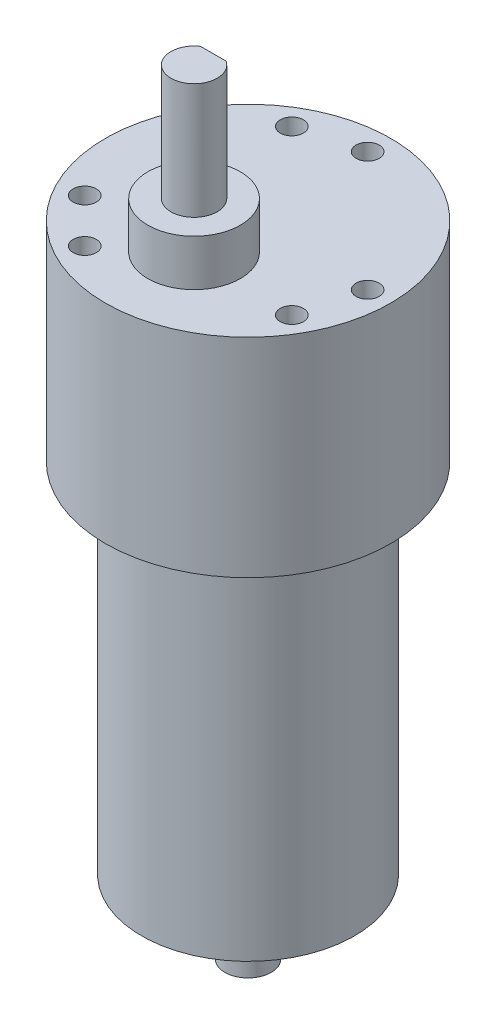
ISO-10303-21;
HEADER;
FILE_DESCRIPTION(('STEP AP214'),'2;1');
FILE_NAME('part.step','',(''),(''),'','','');
FILE_SCHEMA(('AUTOMOTIVE_DESIGN { 1 0 10303 214 1 1 1 1 }'));
ENDSEC;
DATA;
#1=APPLICATION_CONTEXT('core data for automotive mechanical design processes');
#2=APPLICATION_PROTOCOL_DEFINITION('international standard','automotive_design',2000,#1);
#3=PRODUCT_CONTEXT('',#1,'mechanical');
#4=PRODUCT('Part','Part','',(#3));
#5=PRODUCT_RELATED_PRODUCT_CATEGORY('part','',(#4));
#6=PRODUCT_DEFINITION_FORMATION('','',#4);
#7=PRODUCT_DEFINITION_CONTEXT('part definition',#1,'design');
#8=PRODUCT_DEFINITION('design','',#6,#7);
#9=PRODUCT_DEFINITION_SHAPE('','',#8);
#10=(LENGTH_UNIT() NAMED_UNIT(*) SI_UNIT(.MILLI.,.METRE.));
#11=(NAMED_UNIT(*) PLANE_ANGLE_UNIT() SI_UNIT($,.RADIAN.));
#12=(NAMED_UNIT(*) SI_UNIT($,.STERADIAN.) SOLID_ANGLE_UNIT());
#13=UNCERTAINTY_MEASURE_WITH_UNIT(LENGTH_MEASURE(1.E-05),#10,'distance_accuracy_value','');
#14=(GEOMETRIC_REPRESENTATION_CONTEXT(3) GLOBAL_UNCERTAINTY_ASSIGNED_CONTEXT((#13)) GLOBAL_UNIT_ASSIGNED_CONTEXT((#10,
#11,#12)) REPRESENTATION_CONTEXT('',''));
#15=CARTESIAN_POINT('',(0.,0.,0.));
#16=DIRECTION('',(0.,0.,1.));
#17=DIRECTION('',(1.,0.,0.));
#18=AXIS2_PLACEMENT_3D('',#15,#16,#17);
#19=CARTESIAN_POINT('',(0.,27.,0.));
#20=DIRECTION('',(0.,-1.,0.));
#21=DIRECTION('',(0.,0.,-1.));
#22=AXIS2_PLACEMENT_3D('',#19,#20,#21);
#23=CYLINDRICAL_SURFACE('',#22,18.5);
#24=CARTESIAN_POINT('',(0.,27.,0.));
#25=DIRECTION('',(0.,1.,0.));
#26=DIRECTION('',(0.,0.,1.));
#27=AXIS2_PLACEMENT_3D('',#24,#25,#26);
#28=CIRCLE('',#27,18.5);
#29=CARTESIAN_POINT('',(0.,27.,18.5));
#30=VERTEX_POINT('',#29);
#31=EDGE_CURVE('E85',#30,#30,#28,.T.);
#32=ORIENTED_EDGE('',*,*,#31,.F.);
#33=EDGE_LOOP('',(#32));
#34=FACE_BOUND('',#33,.T.);
#35=CARTESIAN_POINT('',(0.,0.,0.));
#36=DIRECTION('',(0.,1.,0.));
#37=DIRECTION('',(0.,0.,1.));
#38=AXIS2_PLACEMENT_3D('',#35,#36,#37);
#39=CIRCLE('',#38,18.5);
#40=CARTESIAN_POINT('',(0.,0.,18.5));
#41=VERTEX_POINT('',#40);
#42=EDGE_CURVE('E36',#41,#41,#39,.T.);
#43=ORIENTED_EDGE('',*,*,#42,.T.);
#44=EDGE_LOOP('',(#43));
#45=FACE_BOUND('',#44,.T.);
#46=ADVANCED_FACE('F33',(#34,#45),#23,.T.);
#47=CARTESIAN_POINT('',(0.,27.,0.));
#48=DIRECTION('',(0.,1.,0.));
#49=DIRECTION('',(0.,0.,1.));
#50=AXIS2_PLACEMENT_3D('',#47,#48,#49);
#51=PLANE('',#50);
#52=CARTESIAN_POINT('',(0.,27.,7.));
#53=DIRECTION('',(0.,1.,0.));
#54=DIRECTION('',(0.,0.,1.));
#55=AXIS2_PLACEMENT_3D('',#52,#53,#54);
#56=CIRCLE('',#55,6.);
#57=CARTESIAN_POINT('',(0.,27.,13.));
#58=VERTEX_POINT('',#57);
#59=EDGE_CURVE('E75',#58,#58,#56,.T.);
#60=ORIENTED_EDGE('',*,*,#59,.F.);
#61=EDGE_LOOP('',(#60));
#62=FACE_BOUND('',#61,.T.);
#63=CARTESIAN_POINT('',(-13.4233937586588,27.,7.75000000000006));
#64=DIRECTION('',(0.,1.,0.));
#65=DIRECTION('',(0.866025403784436,0.,-0.500000000000004));
#66=AXIS2_PLACEMENT_3D('',#63,#64,#65);
#67=CIRCLE('',#66,1.5);
#68=CARTESIAN_POINT('',(-12.1243556529821,27.,7.00000000000006));
#69=VERTEX_POINT('',#68);
#70=EDGE_CURVE('E93',#69,#69,#67,.T.);
#71=ORIENTED_EDGE('',*,*,#70,.F.);
#72=EDGE_LOOP('',(#71));
#73=FACE_BOUND('',#72,.T.);
#74=CARTESIAN_POINT('',(-7.74999999999992,27.,13.4233937586589));
#75=DIRECTION('',(0.,1.,0.));
#76=DIRECTION('',(0.866025403784436,0.,-0.500000000000004));
#77=AXIS2_PLACEMENT_3D('',#74,#75,#76);
#78=CIRCLE('',#77,1.5);
#79=CARTESIAN_POINT('',(-6.45096189432327,27.,12.6733937586588));
#80=VERTEX_POINT('',#79);
#81=EDGE_CURVE('E99',#80,#80,#78,.T.);
#82=ORIENTED_EDGE('',*,*,#81,.F.);
#83=EDGE_LOOP('',(#82));
#84=FACE_BOUND('',#83,.T.);
#85=CARTESIAN_POINT('',(13.4233937586589,27.,7.74999999999987));
#86=DIRECTION('',(0.,1.,0.));
#87=DIRECTION('',(-0.866025403784443,0.,-0.499999999999992));
#88=AXIS2_PLACEMENT_3D('',#85,#86,#87);
#89=CIRCLE('',#88,1.5);
#90=CARTESIAN_POINT('',(12.1243556529822,27.,6.99999999999989));
#91=VERTEX_POINT('',#90);
#92=EDGE_CURVE('E105',#91,#91,#89,.T.);
#93=ORIENTED_EDGE('',*,*,#92,.F.);
#94=EDGE_LOOP('',(#93));
#95=FACE_BOUND('',#94,.T.);
#96=CARTESIAN_POINT('',(15.5,27.,-1.67400815431762E-13));
#97=DIRECTION('',(0.,1.,0.));
#98=DIRECTION('',(-0.866025403784443,0.,-0.499999999999992));
#99=AXIS2_PLACEMENT_3D('',#96,#97,#98);
#100=CIRCLE('',#99,1.5);
#101=CARTESIAN_POINT('',(14.2009618943233,27.,-0.750000000000155));
#102=VERTEX_POINT('',#101);
#103=EDGE_CURVE('E87',#102,#102,#100,.T.);
#104=ORIENTED_EDGE('',*,*,#103,.F.);
#105=EDGE_LOOP('',(#104));
#106=FACE_BOUND('',#105,.T.);
#107=CARTESIAN_POINT('',(0.,27.,-15.5));
#108=DIRECTION('',(0.,1.,0.));
#109=DIRECTION('',(0.,0.,1.));
#110=AXIS2_PLACEMENT_3D('',#107,#108,#109);
#111=CIRCLE('',#110,1.5);
#112=CARTESIAN_POINT('',(0.,27.,-14.));
#113=VERTEX_POINT('',#112);
#114=EDGE_CURVE('E116',#113,#113,#111,.T.);
#115=ORIENTED_EDGE('',*,*,#114,.F.);
#116=EDGE_LOOP('',(#115));
#117=FACE_BOUND('',#116,.T.);
#118=CARTESIAN_POINT('',(-7.75000000000002,27.,-13.4233937586588));
#119=DIRECTION('',(0.,1.,0.));
#120=DIRECTION('',(0.,0.,1.));
#121=AXIS2_PLACEMENT_3D('',#118,#119,#120);
#122=CIRCLE('',#121,1.5);
#123=CARTESIAN_POINT('',(-7.75000000000002,27.,-11.9233937586588));
#124=VERTEX_POINT('',#123);
#125=EDGE_CURVE('E92',#124,#124,#122,.T.);
#126=ORIENTED_EDGE('',*,*,#125,.F.);
#127=EDGE_LOOP('',(#126));
#128=FACE_BOUND('',#127,.T.);
#129=ORIENTED_EDGE('',*,*,#31,.T.);
#130=EDGE_LOOP('',(#129));
#131=FACE_BOUND('',#130,.T.);
#132=ADVANCED_FACE('F133',(#62,#73,#84,#95,#106,#117,#128,#131),#51,.T.);
#133=CARTESIAN_POINT('',(0.,0.,0.));
#134=DIRECTION('',(0.,1.,0.));
#135=DIRECTION('',(0.,0.,1.));
#136=AXIS2_PLACEMENT_3D('',#133,#134,#135);
#137=PLANE('',#136);
#138=CARTESIAN_POINT('',(0.,0.,0.));
#139=DIRECTION('',(0.,-1.,0.));
#140=DIRECTION('',(0.,0.,-1.));
#141=AXIS2_PLACEMENT_3D('',#138,#139,#140);
#142=CIRCLE('',#141,13.8);
#143=CARTESIAN_POINT('',(0.,0.,-13.8));
#144=VERTEX_POINT('',#143);
#145=EDGE_CURVE('E41',#144,#144,#142,.T.);
#146=ORIENTED_EDGE('',*,*,#145,.F.);
#147=EDGE_LOOP('',(#146));
#148=FACE_BOUND('',#147,.T.);
#149=ORIENTED_EDGE('',*,*,#42,.F.);
#150=EDGE_LOOP('',(#149));
#151=FACE_BOUND('',#150,.T.);
#152=ADVANCED_FACE('F130',(#148,#151),#137,.F.);
#153=CARTESIAN_POINT('',(-7.75000000000002,22.,-13.4233937586588));
#154=DIRECTION('',(0.,1.,0.));
#155=DIRECTION('',(0.,0.,1.));
#156=AXIS2_PLACEMENT_3D('',#153,#154,#155);
#157=CYLINDRICAL_SURFACE('',#156,1.5);
#158=CARTESIAN_POINT('',(-7.75000000000002,22.,-13.4233937586588));
#159=DIRECTION('',(0.,1.,0.));
#160=DIRECTION('',(0.,0.,1.));
#161=AXIS2_PLACEMENT_3D('',#158,#159,#160);
#162=CIRCLE('',#161,1.5);
#163=CARTESIAN_POINT('',(-7.75000000000002,22.,-11.9233937586588));
#164=VERTEX_POINT('',#163);
#165=EDGE_CURVE('E119',#164,#164,#162,.T.);
#166=ORIENTED_EDGE('',*,*,#165,.F.);
#167=EDGE_LOOP('',(#166));
#168=FACE_BOUND('',#167,.T.);
#169=ORIENTED_EDGE('',*,*,#125,.T.);
#170=EDGE_LOOP('',(#169));
#171=FACE_BOUND('',#170,.T.);
#172=ADVANCED_FACE('F132',(#168,#171),#157,.F.);
#173=CARTESIAN_POINT('',(-7.75000000000002,22.,-13.4233937586588));
#174=DIRECTION('',(0.,1.,0.));
#175=DIRECTION('',(0.,0.,1.));
#176=AXIS2_PLACEMENT_3D('',#173,#174,#175);
#177=PLANE('',#176);
#178=ORIENTED_EDGE('',*,*,#165,.T.);
#179=EDGE_LOOP('',(#178));
#180=FACE_BOUND('',#179,.T.);
#181=ADVANCED_FACE('F139',(#180),#177,.T.);
#182=CARTESIAN_POINT('',(0.,22.,-15.5));
#183=DIRECTION('',(0.,1.,0.));
#184=DIRECTION('',(0.,0.,1.));
#185=AXIS2_PLACEMENT_3D('',#182,#183,#184);
#186=CYLINDRICAL_SURFACE('',#185,1.5);
#187=CARTESIAN_POINT('',(0.,22.,-15.5));
#188=DIRECTION('',(0.,1.,0.));
#189=DIRECTION('',(0.,0.,1.));
#190=AXIS2_PLACEMENT_3D('',#187,#188,#189);
#191=CIRCLE('',#190,1.5);
#192=CARTESIAN_POINT('',(0.,22.,-14.));
#193=VERTEX_POINT('',#192);
#194=EDGE_CURVE('E113',#193,#193,#191,.T.);
#195=ORIENTED_EDGE('',*,*,#194,.F.);
#196=EDGE_LOOP('',(#195));
#197=FACE_BOUND('',#196,.T.);
#198=ORIENTED_EDGE('',*,*,#114,.T.);
#199=EDGE_LOOP('',(#198));
#200=FACE_BOUND('',#199,.T.);
#201=ADVANCED_FACE('F298',(#197,#200),#186,.F.);
#202=CARTESIAN_POINT('',(0.,22.,-15.5));
#203=DIRECTION('',(0.,1.,0.));
#204=DIRECTION('',(0.,0.,1.));
#205=AXIS2_PLACEMENT_3D('',#202,#203,#204);
#206=PLANE('',#205);
#207=ORIENTED_EDGE('',*,*,#194,.T.);
#208=EDGE_LOOP('',(#207));
#209=FACE_BOUND('',#208,.T.);
#210=ADVANCED_FACE('F294',(#209),#206,.T.);
#211=CARTESIAN_POINT('',(15.5,22.,-1.67400815431762E-13));
#212=DIRECTION('',(0.,1.,0.));
#213=DIRECTION('',(0.,0.,1.));
#214=AXIS2_PLACEMENT_3D('',#211,#212,#213);
#215=CYLINDRICAL_SURFACE('',#214,1.5);
#216=CARTESIAN_POINT('',(15.5,22.,-1.67400815431762E-13));
#217=DIRECTION('',(0.,1.,0.));
#218=DIRECTION('',(-0.866025403784443,0.,-0.499999999999992));
#219=AXIS2_PLACEMENT_3D('',#216,#217,#218);
#220=CIRCLE('',#219,1.5);
#221=CARTESIAN_POINT('',(14.2009618943233,22.,-0.750000000000155));
#222=VERTEX_POINT('',#221);
#223=EDGE_CURVE('E108',#222,#222,#220,.T.);
#224=ORIENTED_EDGE('',*,*,#223,.F.);
#225=EDGE_LOOP('',(#224));
#226=FACE_BOUND('',#225,.T.);
#227=ORIENTED_EDGE('',*,*,#103,.T.);
#228=EDGE_LOOP('',(#227));
#229=FACE_BOUND('',#228,.T.);
#230=ADVANCED_FACE('F290',(#226,#229),#215,.F.);
#231=CARTESIAN_POINT('',(15.5,22.,-1.67400815431762E-13));
#232=DIRECTION('',(0.,1.,0.));
#233=DIRECTION('',(-0.866025403784443,0.,-0.499999999999992));
#234=AXIS2_PLACEMENT_3D('',#231,#232,#233);
#235=PLANE('',#234);
#236=ORIENTED_EDGE('',*,*,#223,.T.);
#237=EDGE_LOOP('',(#236));
#238=FACE_BOUND('',#237,.T.);
#239=ADVANCED_FACE('F286',(#238),#235,.T.);
#240=CARTESIAN_POINT('',(13.4233937586589,22.,7.74999999999987));
#241=DIRECTION('',(0.,1.,0.));
#242=DIRECTION('',(0.,0.,1.));
#243=AXIS2_PLACEMENT_3D('',#240,#241,#242);
#244=CYLINDRICAL_SURFACE('',#243,1.5);
#245=CARTESIAN_POINT('',(13.4233937586589,22.,7.74999999999987));
#246=DIRECTION('',(0.,1.,0.));
#247=DIRECTION('',(-0.866025403784443,0.,-0.499999999999992));
#248=AXIS2_PLACEMENT_3D('',#245,#246,#247);
#249=CIRCLE('',#248,1.5);
#250=CARTESIAN_POINT('',(12.1243556529822,22.,6.99999999999989));
#251=VERTEX_POINT('',#250);
#252=EDGE_CURVE('E102',#251,#251,#249,.T.);
#253=ORIENTED_EDGE('',*,*,#252,.F.);
#254=EDGE_LOOP('',(#253));
#255=FACE_BOUND('',#254,.T.);
#256=ORIENTED_EDGE('',*,*,#92,.T.);
#257=EDGE_LOOP('',(#256));
#258=FACE_BOUND('',#257,.T.);
#259=ADVANCED_FACE('F282',(#255,#258),#244,.F.);
#260=CARTESIAN_POINT('',(13.4233937586589,22.,7.74999999999987));
#261=DIRECTION('',(0.,1.,0.));
#262=DIRECTION('',(-0.866025403784443,0.,-0.499999999999992));
#263=AXIS2_PLACEMENT_3D('',#260,#261,#262);
#264=PLANE('',#263);
#265=ORIENTED_EDGE('',*,*,#252,.T.);
#266=EDGE_LOOP('',(#265));
#267=FACE_BOUND('',#266,.T.);
#268=ADVANCED_FACE('F278',(#267),#264,.T.);
#269=CARTESIAN_POINT('',(-7.74999999999992,22.,13.4233937586589));
#270=DIRECTION('',(0.,1.,0.));
#271=DIRECTION('',(0.,0.,1.));
#272=AXIS2_PLACEMENT_3D('',#269,#270,#271);
#273=CYLINDRICAL_SURFACE('',#272,1.5);
#274=CARTESIAN_POINT('',(-7.74999999999992,22.,13.4233937586589));
#275=DIRECTION('',(0.,1.,0.));
#276=DIRECTION('',(0.866025403784436,0.,-0.500000000000004));
#277=AXIS2_PLACEMENT_3D('',#274,#275,#276);
#278=CIRCLE('',#277,1.5);
#279=CARTESIAN_POINT('',(-6.45096189432327,22.,12.6733937586588));
#280=VERTEX_POINT('',#279);
#281=EDGE_CURVE('E96',#280,#280,#278,.T.);
#282=ORIENTED_EDGE('',*,*,#281,.F.);
#283=EDGE_LOOP('',(#282));
#284=FACE_BOUND('',#283,.T.);
#285=ORIENTED_EDGE('',*,*,#81,.T.);
#286=EDGE_LOOP('',(#285));
#287=FACE_BOUND('',#286,.T.);
#288=ADVANCED_FACE('F274',(#284,#287),#273,.F.);
#289=CARTESIAN_POINT('',(-7.74999999999992,22.,13.4233937586589));
#290=DIRECTION('',(0.,1.,0.));
#291=DIRECTION('',(0.866025403784436,0.,-0.500000000000004));
#292=AXIS2_PLACEMENT_3D('',#289,#290,#291);
#293=PLANE('',#292);
#294=ORIENTED_EDGE('',*,*,#281,.T.);
#295=EDGE_LOOP('',(#294));
#296=FACE_BOUND('',#295,.T.);
#297=ADVANCED_FACE('F270',(#296),#293,.T.);
#298=CARTESIAN_POINT('',(-13.4233937586588,22.,7.75000000000006));
#299=DIRECTION('',(0.,1.,0.));
#300=DIRECTION('',(0.,0.,1.));
#301=AXIS2_PLACEMENT_3D('',#298,#299,#300);
#302=CYLINDRICAL_SURFACE('',#301,1.5);
#303=CARTESIAN_POINT('',(-13.4233937586588,22.,7.75000000000006));
#304=DIRECTION('',(0.,1.,0.));
#305=DIRECTION('',(0.866025403784436,0.,-0.500000000000004));
#306=AXIS2_PLACEMENT_3D('',#303,#304,#305);
#307=CIRCLE('',#306,1.5);
#308=CARTESIAN_POINT('',(-12.1243556529821,22.,7.00000000000006));
#309=VERTEX_POINT('',#308);
#310=EDGE_CURVE('E89',#309,#309,#307,.T.);
#311=ORIENTED_EDGE('',*,*,#310,.F.);
#312=EDGE_LOOP('',(#311));
#313=FACE_BOUND('',#312,.T.);
#314=ORIENTED_EDGE('',*,*,#70,.T.);
#315=EDGE_LOOP('',(#314));
#316=FACE_BOUND('',#315,.T.);
#317=ADVANCED_FACE('F266',(#313,#316),#302,.F.);
#318=CARTESIAN_POINT('',(-13.4233937586588,22.,7.75000000000006));
#319=DIRECTION('',(0.,1.,0.));
#320=DIRECTION('',(0.866025403784436,0.,-0.500000000000004));
#321=AXIS2_PLACEMENT_3D('',#318,#319,#320);
#322=PLANE('',#321);
#323=ORIENTED_EDGE('',*,*,#310,.T.);
#324=EDGE_LOOP('',(#323));
#325=FACE_BOUND('',#324,.T.);
#326=ADVANCED_FACE('F161',(#325),#322,.T.);
#327=CARTESIAN_POINT('',(0.,33.,7.));
#328=DIRECTION('',(0.,-1.,0.));
#329=DIRECTION('',(0.,0.,-1.));
#330=AXIS2_PLACEMENT_3D('',#327,#328,#329);
#331=CYLINDRICAL_SURFACE('',#330,6.);
#332=CARTESIAN_POINT('',(0.,33.,7.));
#333=DIRECTION('',(0.,1.,0.));
#334=DIRECTION('',(0.,0.,1.));
#335=AXIS2_PLACEMENT_3D('',#332,#333,#334);
#336=CIRCLE('',#335,6.);
#337=CARTESIAN_POINT('',(0.,33.,13.));
#338=VERTEX_POINT('',#337);
#339=EDGE_CURVE('E78',#338,#338,#336,.T.);
#340=ORIENTED_EDGE('',*,*,#339,.F.);
#341=EDGE_LOOP('',(#340));
#342=FACE_BOUND('',#341,.T.);
#343=ORIENTED_EDGE('',*,*,#59,.T.);
#344=EDGE_LOOP('',(#343));
#345=FACE_BOUND('',#344,.T.);
#346=ADVANCED_FACE('F166',(#342,#345),#331,.T.);
#347=CARTESIAN_POINT('',(0.,33.,7.));
#348=DIRECTION('',(0.,1.,0.));
#349=DIRECTION('',(0.,0.,1.));
#350=AXIS2_PLACEMENT_3D('',#347,#348,#349);
#351=PLANE('',#350);
#352=CARTESIAN_POINT('',(0.,33.,7.));
#353=DIRECTION('',(0.,1.,0.));
#354=DIRECTION('',(0.,0.,1.));
#355=AXIS2_PLACEMENT_3D('',#352,#353,#354);
#356=CIRCLE('',#355,3.);
#357=CARTESIAN_POINT('',(0.,33.,10.));
#358=VERTEX_POINT('',#357);
#359=EDGE_CURVE('E82',#358,#358,#356,.T.);
#360=ORIENTED_EDGE('',*,*,#359,.F.);
#361=EDGE_LOOP('',(#360));
#362=FACE_BOUND('',#361,.T.);
#363=ORIENTED_EDGE('',*,*,#339,.T.);
#364=EDGE_LOOP('',(#363));
#365=FACE_BOUND('',#364,.T.);
#366=ADVANCED_FACE('F171',(#362,#365),#351,.T.);
#367=CARTESIAN_POINT('',(0.,48.,7.));
#368=DIRECTION('',(0.,-1.,0.));
#369=DIRECTION('',(0.,0.,-1.));
#370=AXIS2_PLACEMENT_3D('',#367,#368,#369);
#371=CYLINDRICAL_SURFACE('',#370,3.);
#372=CARTESIAN_POINT('',(0.,48.,7.));
#373=DIRECTION('',(0.,1.,0.));
#374=DIRECTION('',(0.,0.,1.));
#375=AXIS2_PLACEMENT_3D('',#372,#373,#374);
#376=CIRCLE('',#375,3.);
#377=CARTESIAN_POINT('',(-1.6583123951777,48.,4.5));
#378=VERTEX_POINT('',#377);
#379=CARTESIAN_POINT('',(1.6583123951777,48.,4.5));
#380=VERTEX_POINT('',#379);
#381=EDGE_CURVE('E72',#378,#380,#376,.T.);
#382=ORIENTED_EDGE('',*,*,#381,.F.);
#383=DIRECTION('',(0.,1.,0.));
#384=VECTOR('',#383,1.);
#385=CARTESIAN_POINT('',(-1.6583123951777,36.,4.5));
#386=LINE('',#385,#384);
#387=CARTESIAN_POINT('',(-1.6583123951777,36.,4.5));
#388=VERTEX_POINT('',#387);
#389=EDGE_CURVE('E49',#388,#378,#386,.T.);
#390=ORIENTED_EDGE('',*,*,#389,.F.);
#391=CARTESIAN_POINT('',(0.,36.,7.));
#392=DIRECTION('',(0.,1.,0.));
#393=DIRECTION('',(0.,0.,-1.));
#394=AXIS2_PLACEMENT_3D('',#391,#392,#393);
#395=CIRCLE('',#394,3.);
#396=CARTESIAN_POINT('',(1.6583123951777,36.,4.5));
#397=VERTEX_POINT('',#396);
#398=EDGE_CURVE('E65',#397,#388,#395,.T.);
#399=ORIENTED_EDGE('',*,*,#398,.F.);
#400=DIRECTION('',(0.,1.,0.));
#401=VECTOR('',#400,1.);
#402=CARTESIAN_POINT('',(1.6583123951777,36.,4.5));
#403=LINE('',#402,#401);
#404=EDGE_CURVE('E55',#397,#380,#403,.T.);
#405=ORIENTED_EDGE('',*,*,#404,.T.);
#406=EDGE_LOOP('',(#382,#390,#399,#405));
#407=FACE_BOUND('',#406,.T.);
#408=ORIENTED_EDGE('',*,*,#359,.T.);
#409=EDGE_LOOP('',(#408));
#410=FACE_BOUND('',#409,.T.);
#411=ADVANCED_FACE('F70',(#407,#410),#371,.T.);
#412=CARTESIAN_POINT('',(0.,48.,7.));
#413=DIRECTION('',(0.,1.,0.));
#414=DIRECTION('',(0.,0.,1.));
#415=AXIS2_PLACEMENT_3D('',#412,#413,#414);
#416=PLANE('',#415);
#417=DIRECTION('',(1.,0.,0.));
#418=VECTOR('',#417,1.);
#419=CARTESIAN_POINT('',(-1.6583123951777,48.,4.5));
#420=LINE('',#419,#418);
#421=EDGE_CURVE('E60',#378,#380,#420,.T.);
#422=ORIENTED_EDGE('',*,*,#421,.F.);
#423=ORIENTED_EDGE('',*,*,#381,.T.);
#424=EDGE_LOOP('',(#422,#423));
#425=FACE_BOUND('',#424,.T.);
#426=ADVANCED_FACE('F74',(#425),#416,.T.);
#427=CARTESIAN_POINT('',(-1.6583123951777,36.,4.5));
#428=DIRECTION('',(0.,0.,1.));
#429=DIRECTION('',(1.,0.,0.));
#430=AXIS2_PLACEMENT_3D('',#427,#428,#429);
#431=PLANE('',#430);
#432=ORIENTED_EDGE('',*,*,#421,.T.);
#433=ORIENTED_EDGE('',*,*,#404,.F.);
#434=DIRECTION('',(1.,0.,0.));
#435=VECTOR('',#434,1.);
#436=CARTESIAN_POINT('',(-1.6583123951777,36.,4.5));
#437=LINE('',#436,#435);
#438=EDGE_CURVE('E404',#388,#397,#437,.T.);
#439=ORIENTED_EDGE('',*,*,#438,.F.);
#440=ORIENTED_EDGE('',*,*,#389,.T.);
#441=EDGE_LOOP('',(#432,#433,#439,#440));
#442=FACE_BOUND('',#441,.T.);
#443=ADVANCED_FACE('F61',(#442),#431,.F.);
#444=CARTESIAN_POINT('',(0.,36.,7.));
#445=DIRECTION('',(0.,-1.,0.));
#446=DIRECTION('',(0.,0.,-1.));
#447=AXIS2_PLACEMENT_3D('',#444,#445,#446);
#448=PLANE('',#447);
#449=ORIENTED_EDGE('',*,*,#398,.T.);
#450=ORIENTED_EDGE('',*,*,#438,.T.);
#451=EDGE_LOOP('',(#449,#450));
#452=FACE_BOUND('',#451,.T.);
#453=ADVANCED_FACE('F206',(#452),#448,.F.);
#454=CARTESIAN_POINT('',(0.,-46.4,0.));
#455=DIRECTION('',(0.,1.,0.));
#456=DIRECTION('',(0.,0.,1.));
#457=AXIS2_PLACEMENT_3D('',#454,#455,#456);
#458=CYLINDRICAL_SURFACE('',#457,13.8);
#459=CARTESIAN_POINT('',(0.,-46.4,0.));
#460=DIRECTION('',(0.,-1.,0.));
#461=DIRECTION('',(0.,0.,-1.));
#462=AXIS2_PLACEMENT_3D('',#459,#460,#461);
#463=CIRCLE('',#462,13.8);
#464=CARTESIAN_POINT('',(0.,-46.4,-13.8));
#465=VERTEX_POINT('',#464);
#466=EDGE_CURVE('E66',#465,#465,#463,.T.);
#467=ORIENTED_EDGE('',*,*,#466,.F.);
#468=EDGE_LOOP('',(#467));
#469=FACE_BOUND('',#468,.T.);
#470=ORIENTED_EDGE('',*,*,#145,.T.);
#471=EDGE_LOOP('',(#470));
#472=FACE_BOUND('',#471,.T.);
#473=ADVANCED_FACE('F214',(#469,#472),#458,.T.);
#474=CARTESIAN_POINT('',(0.,-46.4,0.));
#475=DIRECTION('',(0.,-1.,0.));
#476=DIRECTION('',(0.,0.,-1.));
#477=AXIS2_PLACEMENT_3D('',#474,#475,#476);
#478=PLANE('',#477);
#479=CARTESIAN_POINT('',(0.,-46.4,0.));
#480=DIRECTION('',(0.,-1.,0.));
#481=DIRECTION('',(0.,0.,-1.));
#482=AXIS2_PLACEMENT_3D('',#479,#480,#481);
#483=CIRCLE('',#482,3.);
#484=CARTESIAN_POINT('',(0.,-46.4,-3.));
#485=VERTEX_POINT('',#484);
#486=EDGE_CURVE('E11',#485,#485,#483,.T.);
#487=ORIENTED_EDGE('',*,*,#486,.F.);
#488=EDGE_LOOP('',(#487));
#489=FACE_BOUND('',#488,.T.);
#490=ORIENTED_EDGE('',*,*,#466,.T.);
#491=EDGE_LOOP('',(#490));
#492=FACE_BOUND('',#491,.T.);
#493=ADVANCED_FACE('F229',(#489,#492),#478,.T.);
#494=CARTESIAN_POINT('',(0.,-55.9,0.));
#495=DIRECTION('',(0.,1.,0.));
#496=DIRECTION('',(0.,0.,1.));
#497=AXIS2_PLACEMENT_3D('',#494,#495,#496);
#498=CYLINDRICAL_SURFACE('',#497,3.);
#499=CARTESIAN_POINT('',(0.,-55.9,0.));
#500=DIRECTION('',(0.,-1.,0.));
#501=DIRECTION('',(0.,0.,-1.));
#502=AXIS2_PLACEMENT_3D('',#499,#500,#501);
#503=CIRCLE('',#502,3.);
#504=CARTESIAN_POINT('',(0.,-55.9,-3.));
#505=VERTEX_POINT('',#504);
#506=EDGE_CURVE('E396',#505,#505,#503,.T.);
#507=ORIENTED_EDGE('',*,*,#506,.F.);
#508=EDGE_LOOP('',(#507));
#509=FACE_BOUND('',#508,.T.);
#510=ORIENTED_EDGE('',*,*,#486,.T.);
#511=EDGE_LOOP('',(#510));
#512=FACE_BOUND('',#511,.T.);
#513=ADVANCED_FACE('F239',(#509,#512),#498,.T.);
#514=CARTESIAN_POINT('',(0.,-55.9,0.));
#515=DIRECTION('',(0.,-1.,0.));
#516=DIRECTION('',(0.,0.,-1.));
#517=AXIS2_PLACEMENT_3D('',#514,#515,#516);
#518=PLANE('',#517);
#519=ORIENTED_EDGE('',*,*,#506,.T.);
#520=EDGE_LOOP('',(#519));
#521=FACE_BOUND('',#520,.T.);
#522=ADVANCED_FACE('F249',(#521),#518,.T.);
#523=CLOSED_SHELL('',(#46,#132,#152,#172,#181,#201,#210,#230,#239,#259,#268,#288,#297,#317,#326,
#346,#366,#411,#426,#443,#453,#473,#493,#513,#522));
#524=MANIFOLD_SOLID_BREP('B2',#523);
#525=ADVANCED_BREP_SHAPE_REPRESENTATION('',(#18,#524),#14);
#526=SHAPE_DEFINITION_REPRESENTATION(#9,#525);
ENDSEC;
END-ISO-10303-21;
